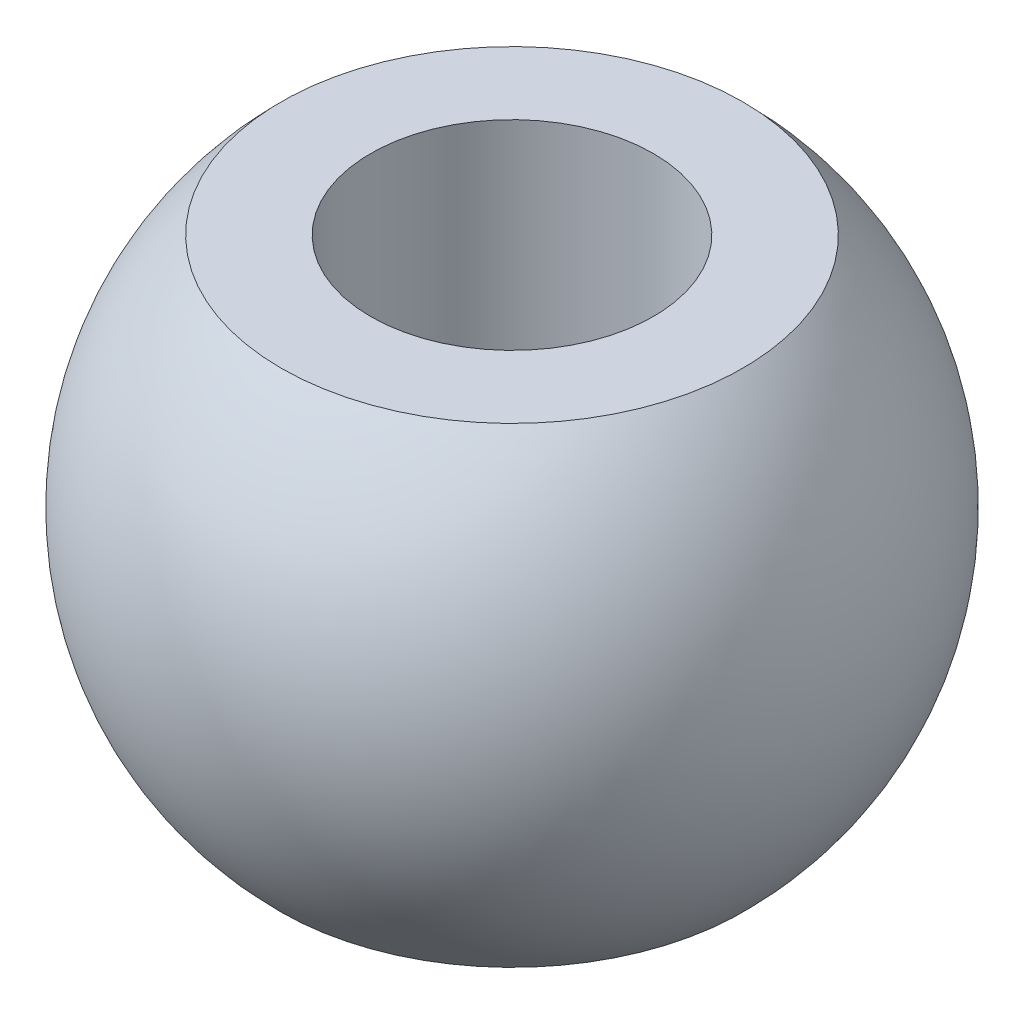
ISO-10303-21;
HEADER;
FILE_DESCRIPTION(('STEP AP214'),'2;1');
FILE_NAME('part.step','',(''),(''),'','','');
FILE_SCHEMA(('AUTOMOTIVE_DESIGN { 1 0 10303 214 1 1 1 1 }'));
ENDSEC;
DATA;
#1=APPLICATION_CONTEXT('core data for automotive mechanical design processes');
#2=APPLICATION_PROTOCOL_DEFINITION('international standard','automotive_design',2000,#1);
#3=PRODUCT_CONTEXT('',#1,'mechanical');
#4=PRODUCT('Part','Part','',(#3));
#5=PRODUCT_RELATED_PRODUCT_CATEGORY('part','',(#4));
#6=PRODUCT_DEFINITION_FORMATION('','',#4);
#7=PRODUCT_DEFINITION_CONTEXT('part definition',#1,'design');
#8=PRODUCT_DEFINITION('design','',#6,#7);
#9=PRODUCT_DEFINITION_SHAPE('','',#8);
#10=(LENGTH_UNIT() NAMED_UNIT(*) SI_UNIT(.MILLI.,.METRE.));
#11=(NAMED_UNIT(*) PLANE_ANGLE_UNIT() SI_UNIT($,.RADIAN.));
#12=(NAMED_UNIT(*) SI_UNIT($,.STERADIAN.) SOLID_ANGLE_UNIT());
#13=UNCERTAINTY_MEASURE_WITH_UNIT(LENGTH_MEASURE(1.E-05),#10,'distance_accuracy_value','');
#14=(GEOMETRIC_REPRESENTATION_CONTEXT(3) GLOBAL_UNCERTAINTY_ASSIGNED_CONTEXT((#13)) GLOBAL_UNIT_ASSIGNED_CONTEXT((#10,
#11,#12)) REPRESENTATION_CONTEXT('',''));
#15=CARTESIAN_POINT('',(0.,0.,0.));
#16=DIRECTION('',(0.,0.,1.));
#17=DIRECTION('',(1.,0.,0.));
#18=AXIS2_PLACEMENT_3D('',#15,#16,#17);
#19=CARTESIAN_POINT('',(-1.5,2.5,0.));
#20=DIRECTION('',(0.,1.,0.));
#21=DIRECTION('',(0.,0.,1.));
#22=AXIS2_PLACEMENT_3D('',#19,#20,#21);
#23=PLANE('',#22);
#24=CARTESIAN_POINT('',(0.,2.5,0.));
#25=DIRECTION('',(0.,1.,0.));
#26=DIRECTION('',(0.,0.,1.));
#27=AXIS2_PLACEMENT_3D('',#24,#25,#26);
#28=CIRCLE('',#27,2.44948974278318);
#29=CARTESIAN_POINT('',(0.,2.5,2.44948974278318));
#30=VERTEX_POINT('',#29);
#31=EDGE_CURVE('E51',#30,#30,#28,.T.);
#32=ORIENTED_EDGE('',*,*,#31,.T.);
#33=EDGE_LOOP('',(#32));
#34=FACE_BOUND('',#33,.T.);
#35=CARTESIAN_POINT('',(0.,2.5,0.));
#36=DIRECTION('',(0.,1.,0.));
#37=DIRECTION('',(0.,0.,1.));
#38=AXIS2_PLACEMENT_3D('',#35,#36,#37);
#39=CIRCLE('',#38,1.5);
#40=CARTESIAN_POINT('',(0.,2.5,1.5));
#41=VERTEX_POINT('',#40);
#42=EDGE_CURVE('E10',#41,#41,#39,.T.);
#43=ORIENTED_EDGE('',*,*,#42,.F.);
#44=EDGE_LOOP('',(#43));
#45=FACE_BOUND('',#44,.T.);
#46=ADVANCED_FACE('F37',(#34,#45),#23,.T.);
#47=CARTESIAN_POINT('',(0.,3.24626865671642,0.));
#48=DIRECTION('',(0.,1.,0.));
#49=DIRECTION('',(0.,0.,1.));
#50=AXIS2_PLACEMENT_3D('',#47,#48,#49);
#51=CYLINDRICAL_SURFACE('',#50,1.5);
#52=ORIENTED_EDGE('',*,*,#42,.T.);
#53=EDGE_LOOP('',(#52));
#54=FACE_BOUND('',#53,.T.);
#55=CARTESIAN_POINT('',(0.,-2.5,0.));
#56=DIRECTION('',(0.,1.,0.));
#57=DIRECTION('',(0.,0.,1.));
#58=AXIS2_PLACEMENT_3D('',#55,#56,#57);
#59=CIRCLE('',#58,1.5);
#60=CARTESIAN_POINT('',(0.,-2.5,1.5));
#61=VERTEX_POINT('',#60);
#62=EDGE_CURVE('E43',#61,#61,#59,.T.);
#63=ORIENTED_EDGE('',*,*,#62,.F.);
#64=EDGE_LOOP('',(#63));
#65=FACE_BOUND('',#64,.T.);
#66=ADVANCED_FACE('F67',(#54,#65),#51,.F.);
#67=CARTESIAN_POINT('',(-1.5,-2.5,0.));
#68=DIRECTION('',(0.,-1.,0.));
#69=DIRECTION('',(0.,0.,-1.));
#70=AXIS2_PLACEMENT_3D('',#67,#68,#69);
#71=PLANE('',#70);
#72=ORIENTED_EDGE('',*,*,#62,.T.);
#73=EDGE_LOOP('',(#72));
#74=FACE_BOUND('',#73,.T.);
#75=CARTESIAN_POINT('',(0.,-2.5,0.));
#76=DIRECTION('',(0.,1.,0.));
#77=DIRECTION('',(0.,0.,1.));
#78=AXIS2_PLACEMENT_3D('',#75,#76,#77);
#79=CIRCLE('',#78,2.44948974278318);
#80=CARTESIAN_POINT('',(0.,-2.5,2.44948974278318));
#81=VERTEX_POINT('',#80);
#82=EDGE_CURVE('E47',#81,#81,#79,.T.);
#83=ORIENTED_EDGE('',*,*,#82,.F.);
#84=EDGE_LOOP('',(#83));
#85=FACE_BOUND('',#84,.T.);
#86=ADVANCED_FACE('F61',(#74,#85),#71,.T.);
#87=CARTESIAN_POINT('',(0.,0.,0.));
#88=DIRECTION('',(0.,1.,0.));
#89=DIRECTION('',(-1.,0.,0.));
#90=AXIS2_PLACEMENT_3D('',#87,#88,#89);
#91=SPHERICAL_SURFACE('',#90,3.50000000000001);
#92=ORIENTED_EDGE('',*,*,#82,.T.);
#93=EDGE_LOOP('',(#92));
#94=FACE_BOUND('',#93,.T.);
#95=ORIENTED_EDGE('',*,*,#31,.F.);
#96=EDGE_LOOP('',(#95));
#97=FACE_BOUND('',#96,.T.);
#98=ADVANCED_FACE('F59',(#94,#97),#91,.T.);
#99=CLOSED_SHELL('',(#46,#66,#86,#98));
#100=MANIFOLD_SOLID_BREP('B2',#99);
#101=ADVANCED_BREP_SHAPE_REPRESENTATION('',(#18,#100),#14);
#102=SHAPE_DEFINITION_REPRESENTATION(#9,#101);
ENDSEC;
END-ISO-10303-21;
